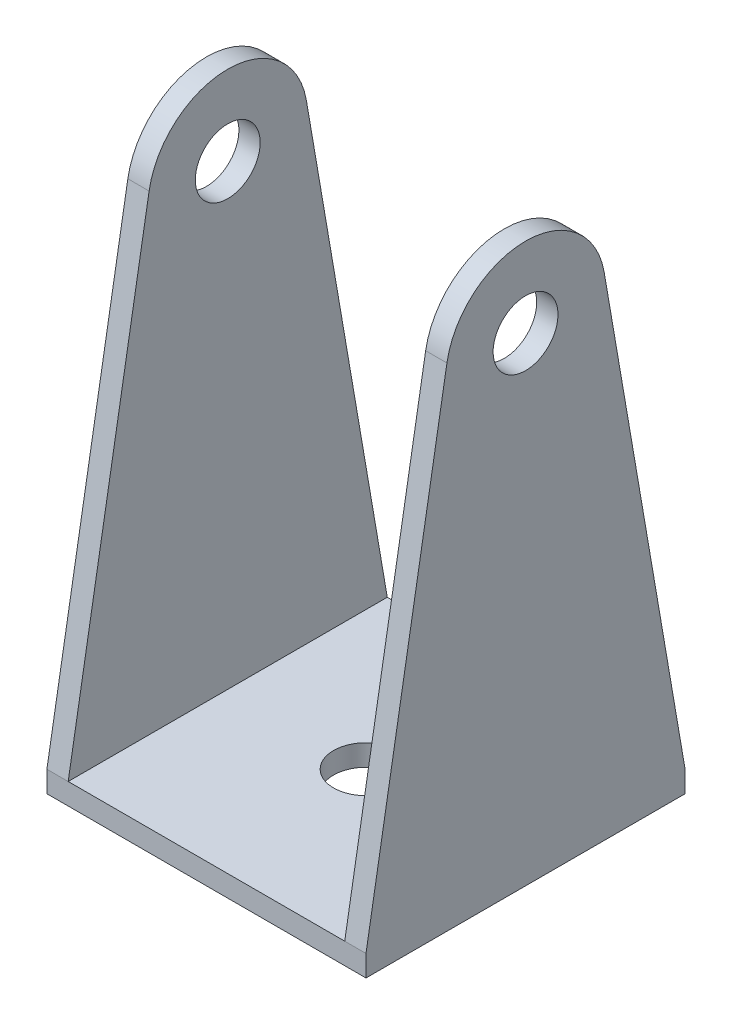
ISO-10303-21;
HEADER;
FILE_DESCRIPTION(('STEP AP214'),'2;1');
FILE_NAME('part.step','',(''),(''),'','','');
FILE_SCHEMA(('AUTOMOTIVE_DESIGN { 1 0 10303 214 1 1 1 1 }'));
ENDSEC;
DATA;
#1=APPLICATION_CONTEXT('core data for automotive mechanical design processes');
#2=APPLICATION_PROTOCOL_DEFINITION('international standard','automotive_design',2000,#1);
#3=PRODUCT_CONTEXT('',#1,'mechanical');
#4=PRODUCT('Part','Part','',(#3));
#5=PRODUCT_RELATED_PRODUCT_CATEGORY('part','',(#4));
#6=PRODUCT_DEFINITION_FORMATION('','',#4);
#7=PRODUCT_DEFINITION_CONTEXT('part definition',#1,'design');
#8=PRODUCT_DEFINITION('design','',#6,#7);
#9=PRODUCT_DEFINITION_SHAPE('','',#8);
#10=(LENGTH_UNIT() NAMED_UNIT(*) SI_UNIT(.MILLI.,.METRE.));
#11=(NAMED_UNIT(*) PLANE_ANGLE_UNIT() SI_UNIT($,.RADIAN.));
#12=(NAMED_UNIT(*) SI_UNIT($,.STERADIAN.) SOLID_ANGLE_UNIT());
#13=UNCERTAINTY_MEASURE_WITH_UNIT(LENGTH_MEASURE(1.E-05),#10,'distance_accuracy_value','');
#14=(GEOMETRIC_REPRESENTATION_CONTEXT(3) GLOBAL_UNCERTAINTY_ASSIGNED_CONTEXT((#13)) GLOBAL_UNIT_ASSIGNED_CONTEXT((#10,
#11,#12)) REPRESENTATION_CONTEXT('',''));
#15=CARTESIAN_POINT('',(0.,0.,0.));
#16=DIRECTION('',(0.,0.,1.));
#17=DIRECTION('',(1.,0.,0.));
#18=AXIS2_PLACEMENT_3D('',#15,#16,#17);
#19=CARTESIAN_POINT('',(-15.,-20.7978366427297,30.));
#20=DIRECTION('',(1.,0.,0.));
#21=DIRECTION('',(0.,1.,0.));
#22=AXIS2_PLACEMENT_3D('',#19,#20,#21);
#23=PLANE('',#22);
#24=CARTESIAN_POINT('',(-15.,-30.7978366427297,15.));
#25=DIRECTION('',(1.,0.,0.));
#26=DIRECTION('',(0.,1.,0.));
#27=AXIS2_PLACEMENT_3D('',#24,#25,#26);
#28=CIRCLE('',#27,3.05);
#29=CARTESIAN_POINT('',(-15.,-27.7478366427297,15.));
#30=VERTEX_POINT('',#29);
#31=EDGE_CURVE('E138',#30,#30,#28,.T.);
#32=ORIENTED_EDGE('',*,*,#31,.T.);
#33=EDGE_LOOP('',(#32));
#34=FACE_BOUND('',#33,.T.);
#35=DIRECTION('',(0.,0.985551111453325,-0.16937829469302));
#36=VECTOR('',#35,1.);
#37=CARTESIAN_POINT('',(-15.,-73.7978366427297,30.));
#38=LINE('',#37,#36);
#39=CARTESIAN_POINT('',(-15.,-73.7978366427297,30.));
#40=VERTEX_POINT('',#39);
#41=CARTESIAN_POINT('',(-15.,-29.527499432532,22.3916333358999));
#42=VERTEX_POINT('',#41);
#43=EDGE_CURVE('E229',#40,#42,#38,.T.);
#44=ORIENTED_EDGE('',*,*,#43,.T.);
#45=CARTESIAN_POINT('',(-15.,-30.7978366427297,15.));
#46=DIRECTION('',(-1.,0.,0.));
#47=DIRECTION('',(0.,-1.,0.));
#48=AXIS2_PLACEMENT_3D('',#45,#46,#47);
#49=CIRCLE('',#48,7.5);
#50=CARTESIAN_POINT('',(-15.,-29.527499432532,7.60836666410006));
#51=VERTEX_POINT('',#50);
#52=EDGE_CURVE('E232',#42,#51,#49,.T.);
#53=ORIENTED_EDGE('',*,*,#52,.T.);
#54=DIRECTION('',(0.,0.985551111453325,0.16937829469302));
#55=VECTOR('',#54,1.);
#56=CARTESIAN_POINT('',(-15.,-73.7978366427297,0.));
#57=LINE('',#56,#55);
#58=CARTESIAN_POINT('',(-15.,-73.7978366427297,0.));
#59=VERTEX_POINT('',#58);
#60=EDGE_CURVE('E238',#59,#51,#57,.T.);
#61=ORIENTED_EDGE('',*,*,#60,.F.);
#62=DIRECTION('',(0.,-1.,0.));
#63=VECTOR('',#62,1.);
#64=CARTESIAN_POINT('',(-15.,-20.7978366427297,0.));
#65=LINE('',#64,#63);
#66=CARTESIAN_POINT('',(-15.,-75.7978366427297,0.));
#67=VERTEX_POINT('',#66);
#68=EDGE_CURVE('E98',#59,#67,#65,.T.);
#69=ORIENTED_EDGE('',*,*,#68,.T.);
#70=DIRECTION('',(0.,0.,-1.));
#71=VECTOR('',#70,1.);
#72=CARTESIAN_POINT('',(-15.,-75.7978366427297,30.));
#73=LINE('',#72,#71);
#74=CARTESIAN_POINT('',(-15.,-75.7978366427297,30.));
#75=VERTEX_POINT('',#74);
#76=EDGE_CURVE('E128',#75,#67,#73,.T.);
#77=ORIENTED_EDGE('',*,*,#76,.F.);
#78=DIRECTION('',(0.,-1.,0.));
#79=VECTOR('',#78,1.);
#80=CARTESIAN_POINT('',(-15.,-20.7978366427297,30.));
#81=LINE('',#80,#79);
#82=EDGE_CURVE('E110',#40,#75,#81,.T.);
#83=ORIENTED_EDGE('',*,*,#82,.F.);
#84=EDGE_LOOP('',(#44,#53,#61,#69,#77,#83));
#85=FACE_BOUND('',#84,.T.);
#86=ADVANCED_FACE('F34',(#34,#85),#23,.F.);
#87=CARTESIAN_POINT('',(15.,-20.7978366427297,30.));
#88=DIRECTION('',(-1.,0.,0.));
#89=DIRECTION('',(0.,-1.,0.));
#90=AXIS2_PLACEMENT_3D('',#87,#88,#89);
#91=PLANE('',#90);
#92=CARTESIAN_POINT('',(15.,-30.7978366427297,15.));
#93=DIRECTION('',(1.,0.,0.));
#94=DIRECTION('',(0.,1.,0.));
#95=AXIS2_PLACEMENT_3D('',#92,#93,#94);
#96=CIRCLE('',#95,3.05);
#97=CARTESIAN_POINT('',(15.,-27.7478366427297,15.));
#98=VERTEX_POINT('',#97);
#99=EDGE_CURVE('E180',#98,#98,#96,.T.);
#100=ORIENTED_EDGE('',*,*,#99,.F.);
#101=EDGE_LOOP('',(#100));
#102=FACE_BOUND('',#101,.T.);
#103=DIRECTION('',(0.,0.985551111453325,-0.16937829469302));
#104=VECTOR('',#103,1.);
#105=CARTESIAN_POINT('',(15.,-22.3183539985248,21.1526587706889));
#106=LINE('',#105,#104);
#107=CARTESIAN_POINT('',(15.,-73.7978366427297,30.));
#108=VERTEX_POINT('',#107);
#109=CARTESIAN_POINT('',(15.,-29.527499432532,22.3916333358999));
#110=VERTEX_POINT('',#109);
#111=EDGE_CURVE('E174',#108,#110,#106,.T.);
#112=ORIENTED_EDGE('',*,*,#111,.F.);
#113=DIRECTION('',(0.,1.,0.));
#114=VECTOR('',#113,1.);
#115=CARTESIAN_POINT('',(15.,-20.7978366427297,30.));
#116=LINE('',#115,#114);
#117=CARTESIAN_POINT('',(15.,-75.7978366427297,30.));
#118=VERTEX_POINT('',#117);
#119=EDGE_CURVE('E122',#118,#108,#116,.T.);
#120=ORIENTED_EDGE('',*,*,#119,.F.);
#121=DIRECTION('',(0.,0.,-1.));
#122=VECTOR('',#121,1.);
#123=CARTESIAN_POINT('',(15.,-75.7978366427297,30.));
#124=LINE('',#123,#122);
#125=CARTESIAN_POINT('',(15.,-75.7978366427297,0.));
#126=VERTEX_POINT('',#125);
#127=EDGE_CURVE('E120',#118,#126,#124,.T.);
#128=ORIENTED_EDGE('',*,*,#127,.T.);
#129=DIRECTION('',(0.,1.,0.));
#130=VECTOR('',#129,1.);
#131=CARTESIAN_POINT('',(15.,-20.7978366427297,0.));
#132=LINE('',#131,#130);
#133=CARTESIAN_POINT('',(15.,-73.7978366427297,0.));
#134=VERTEX_POINT('',#133);
#135=EDGE_CURVE('E111',#126,#134,#132,.T.);
#136=ORIENTED_EDGE('',*,*,#135,.T.);
#137=DIRECTION('',(0.,0.985551111453325,0.16937829469302));
#138=VECTOR('',#137,1.);
#139=CARTESIAN_POINT('',(15.,-17.3104250008016,9.70801143070455));
#140=LINE('',#139,#138);
#141=CARTESIAN_POINT('',(15.,-29.527499432532,7.60836666410006));
#142=VERTEX_POINT('',#141);
#143=EDGE_CURVE('E48',#134,#142,#140,.T.);
#144=ORIENTED_EDGE('',*,*,#143,.T.);
#145=CARTESIAN_POINT('',(15.,-30.7978366427297,15.));
#146=DIRECTION('',(-1.,0.,0.));
#147=DIRECTION('',(0.,-1.,0.));
#148=AXIS2_PLACEMENT_3D('',#145,#146,#147);
#149=CIRCLE('',#148,7.5);
#150=EDGE_CURVE('E177',#110,#142,#149,.T.);
#151=ORIENTED_EDGE('',*,*,#150,.F.);
#152=EDGE_LOOP('',(#112,#120,#128,#136,#144,#151));
#153=FACE_BOUND('',#152,.T.);
#154=ADVANCED_FACE('F197',(#102,#153),#91,.F.);
#155=CARTESIAN_POINT('',(13.,-73.7978366427297,30.));
#156=DIRECTION('',(1.,0.,0.));
#157=DIRECTION('',(0.,1.,0.));
#158=AXIS2_PLACEMENT_3D('',#155,#156,#157);
#159=PLANE('',#158);
#160=CARTESIAN_POINT('',(13.,-30.7978366427297,15.));
#161=DIRECTION('',(1.,0.,0.));
#162=DIRECTION('',(0.,1.,0.));
#163=AXIS2_PLACEMENT_3D('',#160,#161,#162);
#164=CIRCLE('',#163,3.05);
#165=CARTESIAN_POINT('',(13.,-27.7478366427297,15.));
#166=VERTEX_POINT('',#165);
#167=EDGE_CURVE('E137',#166,#166,#164,.T.);
#168=ORIENTED_EDGE('',*,*,#167,.T.);
#169=EDGE_LOOP('',(#168));
#170=FACE_BOUND('',#169,.T.);
#171=DIRECTION('',(0.,-0.985551111453325,0.16937829469302));
#172=VECTOR('',#171,1.);
#173=CARTESIAN_POINT('',(13.,-73.7978366427297,30.));
#174=LINE('',#173,#172);
#175=CARTESIAN_POINT('',(13.,-29.527499432532,22.3916333358999));
#176=VERTEX_POINT('',#175);
#177=CARTESIAN_POINT('',(13.,-73.7978366427297,30.));
#178=VERTEX_POINT('',#177);
#179=EDGE_CURVE('E160',#176,#178,#174,.T.);
#180=ORIENTED_EDGE('',*,*,#179,.F.);
#181=CARTESIAN_POINT('',(13.,-30.7978366427297,15.));
#182=DIRECTION('',(1.,0.,0.));
#183=DIRECTION('',(0.,1.,0.));
#184=AXIS2_PLACEMENT_3D('',#181,#182,#183);
#185=CIRCLE('',#184,7.5);
#186=CARTESIAN_POINT('',(13.,-29.527499432532,7.60836666410006));
#187=VERTEX_POINT('',#186);
#188=EDGE_CURVE('E164',#187,#176,#185,.T.);
#189=ORIENTED_EDGE('',*,*,#188,.F.);
#190=DIRECTION('',(0.,-0.985551111453325,-0.16937829469302));
#191=VECTOR('',#190,1.);
#192=CARTESIAN_POINT('',(13.,-68.7899076450065,0.860670201393469));
#193=LINE('',#192,#191);
#194=CARTESIAN_POINT('',(13.,-73.7978366427297,0.));
#195=VERTEX_POINT('',#194);
#196=EDGE_CURVE('E87',#187,#195,#193,.T.);
#197=ORIENTED_EDGE('',*,*,#196,.T.);
#198=DIRECTION('',(0.,0.,-1.));
#199=VECTOR('',#198,1.);
#200=CARTESIAN_POINT('',(13.,-73.7978366427297,30.));
#201=LINE('',#200,#199);
#202=EDGE_CURVE('E109',#178,#195,#201,.T.);
#203=ORIENTED_EDGE('',*,*,#202,.F.);
#204=EDGE_LOOP('',(#180,#189,#197,#203));
#205=FACE_BOUND('',#204,.T.);
#206=ADVANCED_FACE('F157',(#170,#205),#159,.F.);
#207=CARTESIAN_POINT('',(-13.,-20.7978366427297,30.));
#208=DIRECTION('',(-1.,0.,0.));
#209=DIRECTION('',(0.,-1.,0.));
#210=AXIS2_PLACEMENT_3D('',#207,#208,#209);
#211=PLANE('',#210);
#212=CARTESIAN_POINT('',(-13.,-30.7978366427297,15.));
#213=DIRECTION('',(-1.,0.,0.));
#214=DIRECTION('',(0.,-1.,0.));
#215=AXIS2_PLACEMENT_3D('',#212,#213,#214);
#216=CIRCLE('',#215,3.05);
#217=CARTESIAN_POINT('',(-13.,-33.8478366427297,15.));
#218=VERTEX_POINT('',#217);
#219=EDGE_CURVE('E135',#218,#218,#216,.T.);
#220=ORIENTED_EDGE('',*,*,#219,.T.);
#221=EDGE_LOOP('',(#220));
#222=FACE_BOUND('',#221,.T.);
#223=DIRECTION('',(0.,0.985551111453325,-0.16937829469302));
#224=VECTOR('',#223,1.);
#225=CARTESIAN_POINT('',(-13.,-22.3183539985248,21.1526587706889));
#226=LINE('',#225,#224);
#227=CARTESIAN_POINT('',(-13.,-73.7978366427297,30.));
#228=VERTEX_POINT('',#227);
#229=CARTESIAN_POINT('',(-13.,-29.527499432532,22.3916333358999));
#230=VERTEX_POINT('',#229);
#231=EDGE_CURVE('E116',#228,#230,#226,.T.);
#232=ORIENTED_EDGE('',*,*,#231,.F.);
#233=DIRECTION('',(0.,0.,-1.));
#234=VECTOR('',#233,1.);
#235=CARTESIAN_POINT('',(-13.,-73.7978366427297,30.));
#236=LINE('',#235,#234);
#237=CARTESIAN_POINT('',(-13.,-73.7978366427297,0.));
#238=VERTEX_POINT('',#237);
#239=EDGE_CURVE('E107',#228,#238,#236,.T.);
#240=ORIENTED_EDGE('',*,*,#239,.T.);
#241=DIRECTION('',(0.,0.985551111453325,0.16937829469302));
#242=VECTOR('',#241,1.);
#243=CARTESIAN_POINT('',(-13.,-17.3104250008016,9.70801143070455));
#244=LINE('',#243,#242);
#245=CARTESIAN_POINT('',(-13.,-29.527499432532,7.60836666410006));
#246=VERTEX_POINT('',#245);
#247=EDGE_CURVE('E74',#238,#246,#244,.T.);
#248=ORIENTED_EDGE('',*,*,#247,.T.);
#249=CARTESIAN_POINT('',(-13.,-30.7978366427297,15.));
#250=DIRECTION('',(-1.,0.,0.));
#251=DIRECTION('',(0.,-1.,0.));
#252=AXIS2_PLACEMENT_3D('',#249,#250,#251);
#253=CIRCLE('',#252,7.5);
#254=EDGE_CURVE('E11',#230,#246,#253,.T.);
#255=ORIENTED_EDGE('',*,*,#254,.F.);
#256=EDGE_LOOP('',(#232,#240,#248,#255));
#257=FACE_BOUND('',#256,.T.);
#258=ADVANCED_FACE('F114',(#222,#257),#211,.F.);
#259=CARTESIAN_POINT('',(0.,0.,30.));
#260=DIRECTION('',(0.,0.,1.));
#261=DIRECTION('',(1.,0.,0.));
#262=AXIS2_PLACEMENT_3D('',#259,#260,#261);
#263=PLANE('',#262);
#264=ORIENTED_EDGE('',*,*,#119,.T.);
#265=DIRECTION('',(-1.,0.,0.));
#266=VECTOR('',#265,1.);
#267=CARTESIAN_POINT('',(0.,-73.7978366427297,30.));
#268=LINE('',#267,#266);
#269=EDGE_CURVE('E41',#108,#178,#268,.T.);
#270=ORIENTED_EDGE('',*,*,#269,.T.);
#271=DIRECTION('',(-1.,0.,0.));
#272=VECTOR('',#271,1.);
#273=CARTESIAN_POINT('',(-13.,-73.7978366427297,30.));
#274=LINE('',#273,#272);
#275=EDGE_CURVE('E118',#178,#228,#274,.T.);
#276=ORIENTED_EDGE('',*,*,#275,.T.);
#277=EDGE_CURVE('E99',#228,#40,#268,.T.);
#278=ORIENTED_EDGE('',*,*,#277,.T.);
#279=ORIENTED_EDGE('',*,*,#82,.T.);
#280=DIRECTION('',(1.,0.,0.));
#281=VECTOR('',#280,1.);
#282=CARTESIAN_POINT('',(-15.,-75.7978366427297,30.));
#283=LINE('',#282,#281);
#284=EDGE_CURVE('E57',#75,#118,#283,.T.);
#285=ORIENTED_EDGE('',*,*,#284,.T.);
#286=EDGE_LOOP('',(#264,#270,#276,#278,#279,#285));
#287=FACE_BOUND('',#286,.T.);
#288=ADVANCED_FACE('F146',(#287),#263,.T.);
#289=CARTESIAN_POINT('',(-15.,-75.7978366427297,30.));
#290=DIRECTION('',(0.,1.,0.));
#291=DIRECTION('',(0.,0.,1.));
#292=AXIS2_PLACEMENT_3D('',#289,#290,#291);
#293=PLANE('',#292);
#294=CARTESIAN_POINT('',(0.,-75.7978366427297,15.));
#295=DIRECTION('',(0.,-1.,0.));
#296=DIRECTION('',(0.,0.,-1.));
#297=AXIS2_PLACEMENT_3D('',#294,#295,#296);
#298=CIRCLE('',#297,3.05);
#299=CARTESIAN_POINT('',(0.,-75.7978366427297,11.95));
#300=VERTEX_POINT('',#299);
#301=EDGE_CURVE('E134',#300,#300,#298,.T.);
#302=ORIENTED_EDGE('',*,*,#301,.F.);
#303=EDGE_LOOP('',(#302));
#304=FACE_BOUND('',#303,.T.);
#305=DIRECTION('',(1.,0.,0.));
#306=VECTOR('',#305,1.);
#307=CARTESIAN_POINT('',(-15.,-75.7978366427297,0.));
#308=LINE('',#307,#306);
#309=EDGE_CURVE('E193',#67,#126,#308,.T.);
#310=ORIENTED_EDGE('',*,*,#309,.T.);
#311=ORIENTED_EDGE('',*,*,#127,.F.);
#312=ORIENTED_EDGE('',*,*,#284,.F.);
#313=ORIENTED_EDGE('',*,*,#76,.T.);
#314=EDGE_LOOP('',(#310,#311,#312,#313));
#315=FACE_BOUND('',#314,.T.);
#316=ADVANCED_FACE('F263',(#304,#315),#293,.F.);
#317=CARTESIAN_POINT('',(-13.,-73.7978366427297,30.));
#318=DIRECTION('',(0.,-1.,0.));
#319=DIRECTION('',(0.,0.,-1.));
#320=AXIS2_PLACEMENT_3D('',#317,#318,#319);
#321=PLANE('',#320);
#322=CARTESIAN_POINT('',(0.,-73.7978366427297,15.));
#323=DIRECTION('',(0.,-1.,0.));
#324=DIRECTION('',(0.,0.,-1.));
#325=AXIS2_PLACEMENT_3D('',#322,#323,#324);
#326=CIRCLE('',#325,3.05);
#327=CARTESIAN_POINT('',(0.,-73.7978366427297,11.95));
#328=VERTEX_POINT('',#327);
#329=EDGE_CURVE('E131',#328,#328,#326,.T.);
#330=ORIENTED_EDGE('',*,*,#329,.T.);
#331=EDGE_LOOP('',(#330));
#332=FACE_BOUND('',#331,.T.);
#333=DIRECTION('',(-1.,0.,0.));
#334=VECTOR('',#333,1.);
#335=CARTESIAN_POINT('',(-13.,-73.7978366427297,0.));
#336=LINE('',#335,#334);
#337=EDGE_CURVE('E96',#195,#238,#336,.T.);
#338=ORIENTED_EDGE('',*,*,#337,.T.);
#339=ORIENTED_EDGE('',*,*,#239,.F.);
#340=ORIENTED_EDGE('',*,*,#275,.F.);
#341=ORIENTED_EDGE('',*,*,#202,.T.);
#342=EDGE_LOOP('',(#338,#339,#340,#341));
#343=FACE_BOUND('',#342,.T.);
#344=ADVANCED_FACE('F105',(#332,#343),#321,.F.);
#345=CARTESIAN_POINT('',(0.,0.,0.));
#346=DIRECTION('',(0.,0.,1.));
#347=DIRECTION('',(1.,0.,0.));
#348=AXIS2_PLACEMENT_3D('',#345,#346,#347);
#349=PLANE('',#348);
#350=ORIENTED_EDGE('',*,*,#68,.F.);
#351=DIRECTION('',(1.,0.,0.));
#352=VECTOR('',#351,1.);
#353=CARTESIAN_POINT('',(0.,-73.7978366427297,0.));
#354=LINE('',#353,#352);
#355=EDGE_CURVE('E79',#59,#238,#354,.T.);
#356=ORIENTED_EDGE('',*,*,#355,.T.);
#357=ORIENTED_EDGE('',*,*,#337,.F.);
#358=EDGE_CURVE('E100',#195,#134,#354,.T.);
#359=ORIENTED_EDGE('',*,*,#358,.T.);
#360=ORIENTED_EDGE('',*,*,#135,.F.);
#361=ORIENTED_EDGE('',*,*,#309,.F.);
#362=EDGE_LOOP('',(#350,#356,#357,#359,#360,#361));
#363=FACE_BOUND('',#362,.T.);
#364=ADVANCED_FACE('F94',(#363),#349,.F.);
#365=CARTESIAN_POINT('',(0.,-45.7978366427297,15.));
#366=DIRECTION('',(0.,-1.,0.));
#367=DIRECTION('',(0.,0.,-1.));
#368=AXIS2_PLACEMENT_3D('',#365,#366,#367);
#369=CYLINDRICAL_SURFACE('',#368,3.05);
#370=ORIENTED_EDGE('',*,*,#301,.T.);
#371=EDGE_LOOP('',(#370));
#372=FACE_BOUND('',#371,.T.);
#373=ORIENTED_EDGE('',*,*,#329,.F.);
#374=EDGE_LOOP('',(#373));
#375=FACE_BOUND('',#374,.T.);
#376=ADVANCED_FACE('F282',(#372,#375),#369,.F.);
#377=CARTESIAN_POINT('',(-15.,-30.7978366427297,15.));
#378=DIRECTION('',(1.,0.,0.));
#379=DIRECTION('',(0.,1.,0.));
#380=AXIS2_PLACEMENT_3D('',#377,#378,#379);
#381=CYLINDRICAL_SURFACE('',#380,3.05);
#382=ORIENTED_EDGE('',*,*,#31,.F.);
#383=EDGE_LOOP('',(#382));
#384=FACE_BOUND('',#383,.T.);
#385=ORIENTED_EDGE('',*,*,#219,.F.);
#386=EDGE_LOOP('',(#385));
#387=FACE_BOUND('',#386,.T.);
#388=ADVANCED_FACE('F211',(#384,#387),#381,.F.);
#389=ORIENTED_EDGE('',*,*,#99,.T.);
#390=EDGE_LOOP('',(#389));
#391=FACE_BOUND('',#390,.T.);
#392=ORIENTED_EDGE('',*,*,#167,.F.);
#393=EDGE_LOOP('',(#392));
#394=FACE_BOUND('',#393,.T.);
#395=ADVANCED_FACE('F202',(#391,#394),#381,.F.);
#396=CARTESIAN_POINT('',(39.,-73.7978366427297,0.));
#397=DIRECTION('',(0.,-0.16937829469302,0.985551111453325));
#398=DIRECTION('',(0.,-0.985551111453325,-0.16937829469302));
#399=AXIS2_PLACEMENT_3D('',#396,#397,#398);
#400=PLANE('',#399);
#401=ORIENTED_EDGE('',*,*,#358,.F.);
#402=ORIENTED_EDGE('',*,*,#196,.F.);
#403=DIRECTION('',(-1.,0.,0.));
#404=VECTOR('',#403,1.);
#405=CARTESIAN_POINT('',(39.,-29.527499432532,7.60836666410006));
#406=LINE('',#405,#404);
#407=EDGE_CURVE('E242',#142,#187,#406,.T.);
#408=ORIENTED_EDGE('',*,*,#407,.F.);
#409=ORIENTED_EDGE('',*,*,#143,.F.);
#410=EDGE_LOOP('',(#401,#402,#408,#409));
#411=FACE_BOUND('',#410,.T.);
#412=ADVANCED_FACE('F199',(#411),#400,.F.);
#413=CARTESIAN_POINT('',(39.,-73.7978366427297,30.));
#414=DIRECTION('',(0.,0.16937829469302,0.985551111453325));
#415=DIRECTION('',(0.,-0.985551111453325,0.16937829469302));
#416=AXIS2_PLACEMENT_3D('',#413,#414,#415);
#417=PLANE('',#416);
#418=ORIENTED_EDGE('',*,*,#111,.T.);
#419=DIRECTION('',(-1.,0.,0.));
#420=VECTOR('',#419,1.);
#421=CARTESIAN_POINT('',(39.,-29.527499432532,22.3916333358999));
#422=LINE('',#421,#420);
#423=EDGE_CURVE('E88',#110,#176,#422,.T.);
#424=ORIENTED_EDGE('',*,*,#423,.T.);
#425=ORIENTED_EDGE('',*,*,#179,.T.);
#426=ORIENTED_EDGE('',*,*,#269,.F.);
#427=EDGE_LOOP('',(#418,#424,#425,#426));
#428=FACE_BOUND('',#427,.T.);
#429=ADVANCED_FACE('F201',(#428),#417,.T.);
#430=CARTESIAN_POINT('',(39.,-30.7978366427297,15.));
#431=DIRECTION('',(-1.,0.,0.));
#432=DIRECTION('',(0.,-1.,0.));
#433=AXIS2_PLACEMENT_3D('',#430,#431,#432);
#434=CYLINDRICAL_SURFACE('',#433,7.5);
#435=ORIENTED_EDGE('',*,*,#150,.T.);
#436=ORIENTED_EDGE('',*,*,#407,.T.);
#437=ORIENTED_EDGE('',*,*,#188,.T.);
#438=ORIENTED_EDGE('',*,*,#423,.F.);
#439=EDGE_LOOP('',(#435,#436,#437,#438));
#440=FACE_BOUND('',#439,.T.);
#441=ADVANCED_FACE('F208',(#440),#434,.T.);
#442=ORIENTED_EDGE('',*,*,#254,.T.);
#443=EDGE_CURVE('E83',#246,#51,#406,.T.);
#444=ORIENTED_EDGE('',*,*,#443,.T.);
#445=ORIENTED_EDGE('',*,*,#52,.F.);
#446=EDGE_CURVE('E243',#230,#42,#422,.T.);
#447=ORIENTED_EDGE('',*,*,#446,.F.);
#448=EDGE_LOOP('',(#442,#444,#445,#447));
#449=FACE_BOUND('',#448,.T.);
#450=ADVANCED_FACE('F259',(#449),#434,.T.);
#451=ORIENTED_EDGE('',*,*,#231,.T.);
#452=ORIENTED_EDGE('',*,*,#446,.T.);
#453=ORIENTED_EDGE('',*,*,#43,.F.);
#454=ORIENTED_EDGE('',*,*,#277,.F.);
#455=EDGE_LOOP('',(#451,#452,#453,#454));
#456=FACE_BOUND('',#455,.T.);
#457=ADVANCED_FACE('F210',(#456),#417,.T.);
#458=ORIENTED_EDGE('',*,*,#355,.F.);
#459=ORIENTED_EDGE('',*,*,#60,.T.);
#460=ORIENTED_EDGE('',*,*,#443,.F.);
#461=ORIENTED_EDGE('',*,*,#247,.F.);
#462=EDGE_LOOP('',(#458,#459,#460,#461));
#463=FACE_BOUND('',#462,.T.);
#464=ADVANCED_FACE('F76',(#463),#400,.F.);
#465=CLOSED_SHELL('',(#86,#154,#206,#258,#288,#316,#344,#364,#376,#388,#395,#412,#429,#441,#450,
#457,#464));
#466=MANIFOLD_SOLID_BREP('B2',#465);
#467=ADVANCED_BREP_SHAPE_REPRESENTATION('',(#18,#466),#14);
#468=SHAPE_DEFINITION_REPRESENTATION(#9,#467);
ENDSEC;
END-ISO-10303-21;
